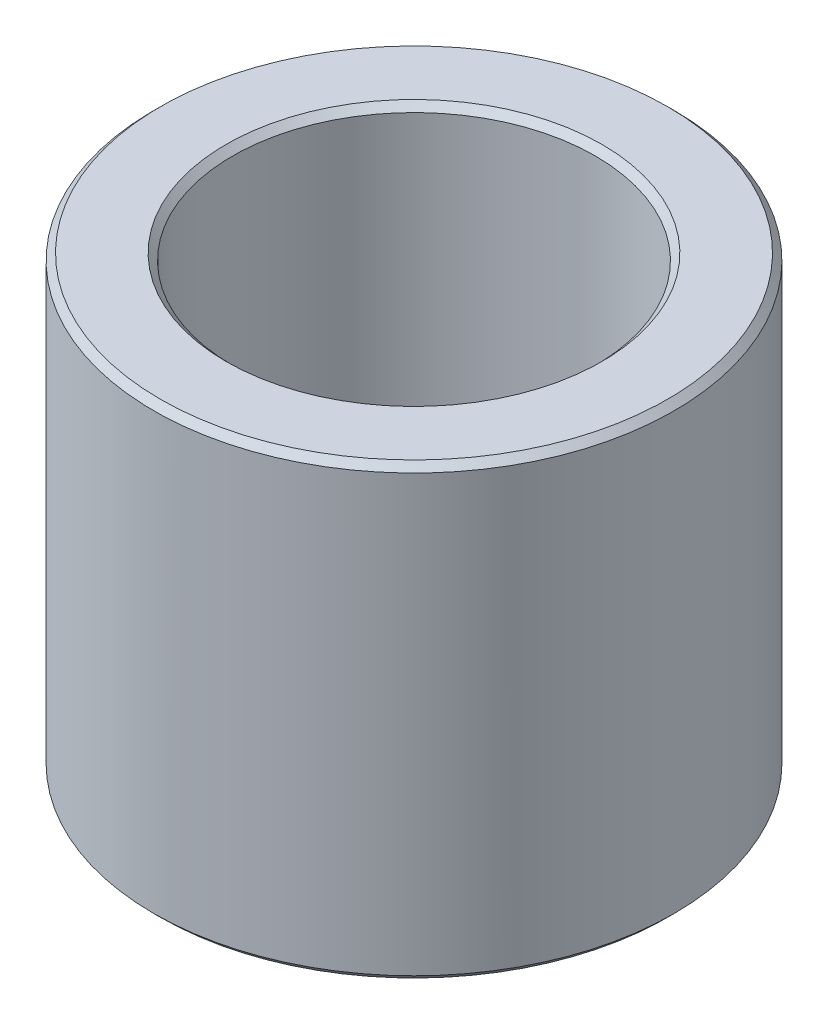
ISO-10303-21;
HEADER;
FILE_DESCRIPTION(('STEP AP214'),'2;1');
FILE_NAME('part.step','',(''),(''),'','','');
FILE_SCHEMA(('AUTOMOTIVE_DESIGN { 1 0 10303 214 1 1 1 1 }'));
ENDSEC;
DATA;
#1=APPLICATION_CONTEXT('core data for automotive mechanical design processes');
#2=APPLICATION_PROTOCOL_DEFINITION('international standard','automotive_design',2000,#1);
#3=PRODUCT_CONTEXT('',#1,'mechanical');
#4=PRODUCT('Part','Part','',(#3));
#5=PRODUCT_RELATED_PRODUCT_CATEGORY('part','',(#4));
#6=PRODUCT_DEFINITION_FORMATION('','',#4);
#7=PRODUCT_DEFINITION_CONTEXT('part definition',#1,'design');
#8=PRODUCT_DEFINITION('design','',#6,#7);
#9=PRODUCT_DEFINITION_SHAPE('','',#8);
#10=(LENGTH_UNIT() NAMED_UNIT(*) SI_UNIT(.MILLI.,.METRE.));
#11=(NAMED_UNIT(*) PLANE_ANGLE_UNIT() SI_UNIT($,.RADIAN.));
#12=(NAMED_UNIT(*) SI_UNIT($,.STERADIAN.) SOLID_ANGLE_UNIT());
#13=UNCERTAINTY_MEASURE_WITH_UNIT(LENGTH_MEASURE(1.E-05),#10,'distance_accuracy_value','');
#14=(GEOMETRIC_REPRESENTATION_CONTEXT(3) GLOBAL_UNCERTAINTY_ASSIGNED_CONTEXT((#13)) GLOBAL_UNIT_ASSIGNED_CONTEXT((#10,
#11,#12)) REPRESENTATION_CONTEXT('',''));
#15=CARTESIAN_POINT('',(0.,0.,0.));
#16=DIRECTION('',(0.,0.,1.));
#17=DIRECTION('',(1.,0.,0.));
#18=AXIS2_PLACEMENT_3D('',#15,#16,#17);
#19=CARTESIAN_POINT('',(0.,60.3581401144129,0.));
#20=DIRECTION('',(0.,-1.,0.));
#21=DIRECTION('',(0.,0.,-1.));
#22=AXIS2_PLACEMENT_3D('',#19,#20,#21);
#23=CYLINDRICAL_SURFACE('',#22,35.);
#24=CARTESIAN_POINT('',(0.,0.893999910343758,0.));
#25=DIRECTION('',(0.,1.,0.));
#26=DIRECTION('',(0.,0.,1.));
#27=AXIS2_PLACEMENT_3D('',#24,#25,#26);
#28=CIRCLE('',#27,35.);
#29=CARTESIAN_POINT('',(0.,0.893999910343751,-35.));
#30=VERTEX_POINT('',#29);
#31=EDGE_CURVE('E10',#30,#30,#28,.T.);
#32=CARTESIAN_POINT('',(0.,59.4641402040693,0.));
#33=DIRECTION('',(0.,1.,0.));
#34=DIRECTION('',(0.,0.,1.));
#35=AXIS2_PLACEMENT_3D('',#32,#33,#34);
#36=CIRCLE('',#35,35.);
#37=CARTESIAN_POINT('',(0.,59.4641402040693,-35.));
#38=VERTEX_POINT('',#37);
#39=EDGE_CURVE('E50',#38,#38,#36,.F.);
#40=CARTESIAN_POINT('',(0.,0.893999910343751,-35.));
#41=CARTESIAN_POINT('',(0.,1.50410553840339,-35.));
#42=CARTESIAN_POINT('',(0.,2.11421116646303,-35.));
#43=CARTESIAN_POINT('',(0.,3.33442242258232,-35.));
#44=CARTESIAN_POINT('',(0.,3.94452805064196,-35.));
#45=CARTESIAN_POINT('',(0.,5.16473930676124,-35.));
#46=CARTESIAN_POINT('',(0.,5.77484493482088,-35.));
#47=CARTESIAN_POINT('',(0.,6.99505619094016,-35.));
#48=CARTESIAN_POINT('',(0.,7.6051618189998,-35.));
#49=CARTESIAN_POINT('',(0.,8.82537307511908,-35.));
#50=CARTESIAN_POINT('',(0.,9.43547870317873,-35.));
#51=CARTESIAN_POINT('',(0.,10.655689959298,-35.));
#52=CARTESIAN_POINT('',(0.,11.2657955873576,-35.));
#53=CARTESIAN_POINT('',(0.,12.4860068434769,-35.));
#54=CARTESIAN_POINT('',(0.,13.0961124715366,-35.));
#55=CARTESIAN_POINT('',(0.,14.3163237276558,-35.));
#56=CARTESIAN_POINT('',(0.,14.9264293557155,-35.));
#57=CARTESIAN_POINT('',(0.,16.1466406118348,-35.));
#58=CARTESIAN_POINT('',(0.,16.7567462398944,-35.));
#59=CARTESIAN_POINT('',(0.,17.9769574960137,-35.));
#60=CARTESIAN_POINT('',(0.,18.5870631240733,-35.));
#61=CARTESIAN_POINT('',(0.,19.8072743801926,-35.));
#62=CARTESIAN_POINT('',(0.,20.4173800082523,-35.));
#63=CARTESIAN_POINT('',(0.,21.6375912643715,-35.));
#64=CARTESIAN_POINT('',(0.,22.2476968924312,-35.));
#65=CARTESIAN_POINT('',(0.,23.4679081485505,-35.));
#66=CARTESIAN_POINT('',(0.,24.0780137766101,-35.));
#67=CARTESIAN_POINT('',(0.,25.2982250327294,-35.));
#68=CARTESIAN_POINT('',(0.,25.908330660789,-35.));
#69=CARTESIAN_POINT('',(0.,27.1285419169083,-35.));
#70=CARTESIAN_POINT('',(0.,27.7386475449679,-35.));
#71=CARTESIAN_POINT('',(0.,28.9588588010872,-35.));
#72=CARTESIAN_POINT('',(0.,29.5689644291469,-35.));
#73=CARTESIAN_POINT('',(0.,30.7891756852661,-35.));
#74=CARTESIAN_POINT('',(0.,31.3992813133258,-35.));
#75=CARTESIAN_POINT('',(0.,32.6194925694451,-35.));
#76=CARTESIAN_POINT('',(0.,33.2295981975047,-35.));
#77=CARTESIAN_POINT('',(0.,34.449809453624,-35.));
#78=CARTESIAN_POINT('',(0.,35.0599150816836,-35.));
#79=CARTESIAN_POINT('',(0.,36.2801263378029,-35.));
#80=CARTESIAN_POINT('',(0.,36.8902319658626,-35.));
#81=CARTESIAN_POINT('',(0.,38.1104432219818,-35.));
#82=CARTESIAN_POINT('',(0.,38.7205488500415,-35.));
#83=CARTESIAN_POINT('',(0.,39.9407601061607,-35.));
#84=CARTESIAN_POINT('',(0.,40.5508657342204,-35.));
#85=CARTESIAN_POINT('',(0.,41.7710769903397,-35.));
#86=CARTESIAN_POINT('',(0.,42.3811826183993,-35.));
#87=CARTESIAN_POINT('',(0.,43.6013938745186,-35.));
#88=CARTESIAN_POINT('',(0.,44.2114995025782,-35.));
#89=CARTESIAN_POINT('',(0.,45.4317107586975,-35.));
#90=CARTESIAN_POINT('',(0.,46.0418163867572,-35.));
#91=CARTESIAN_POINT('',(0.,47.2620276428764,-35.));
#92=CARTESIAN_POINT('',(0.,47.8721332709361,-35.));
#93=CARTESIAN_POINT('',(0.,49.0923445270554,-35.));
#94=CARTESIAN_POINT('',(0.,49.702450155115,-35.));
#95=CARTESIAN_POINT('',(0.,50.9226614112343,-35.));
#96=CARTESIAN_POINT('',(0.,51.5327670392939,-35.));
#97=CARTESIAN_POINT('',(0.,52.7529782954132,-35.));
#98=CARTESIAN_POINT('',(0.,53.3630839234728,-35.));
#99=CARTESIAN_POINT('',(0.,54.5832951795921,-35.));
#100=CARTESIAN_POINT('',(0.,55.1934008076518,-35.));
#101=CARTESIAN_POINT('',(0.,56.413612063771,-35.));
#102=CARTESIAN_POINT('',(0.,57.0237176918307,-35.));
#103=CARTESIAN_POINT('',(0.,58.24392894795,-35.));
#104=CARTESIAN_POINT('',(0.,58.8540345760096,-35.));
#105=CARTESIAN_POINT('',(0.,59.4641402040693,-35.));
#106=B_SPLINE_CURVE_WITH_KNOTS('',3,(#40,#41,#42,#43,#44,#45,#46,#47,#48,#49,#50,#51,#52,#53,
#54,#55,#56,#57,#58,#59,#60,#61,#62,#63,#64,#65,#66,#67,#68,#69,#70,#71,#72,#73,#74,#75,#76,#77,
#78,#79,#80,#81,#82,#83,#84,#85,#86,#87,#88,#89,#90,#91,#92,#93,#94,#95,#96,#97,#98,#99,#100,
#101,#102,#103,#104,#105),.UNSPECIFIED.,.F.,.F.,(4,2,2,2,2,2,2,2,2,2,2,2,2,2,2,2,2,2,2,2,2,2,2,
2,2,2,2,2,2,2,2,2,4),(0.,1.83031688417892,3.66063376835785,5.49095065253677,7.32126753671569,
9.15158442089461,10.9819013050735,12.8122181892525,14.6425350734314,16.4728519576103,
18.3031688417892,20.1334857259681,21.9638026101471,23.794119494326,25.6244363785049,
27.4547532626838,29.2850701468628,31.1153870310417,32.9457039152206,34.7760207993995,
36.6063376835784,38.4366545677574,40.2669714519363,42.0972883361152,43.9276052202941,
45.757922104473,47.588238988652,49.4185558728309,51.2488727570098,53.0791896411887,
54.9095065253677,56.7398234095466,58.5701402937255),.UNSPECIFIED.);
#107=EDGE_CURVE('BSEAM39',#30,#38,#106,.T.);
#108=ORIENTED_EDGE('',*,*,#31,.T.);
#109=ORIENTED_EDGE('',*,*,#39,.T.);
#110=ORIENTED_EDGE('',*,*,#107,.T.);
#111=ORIENTED_EDGE('',*,*,#107,.F.);
#112=EDGE_LOOP('',(#108,#110,#109,#111));
#113=FACE_BOUND('',#112,.T.);
#114=ADVANCED_FACE('F39',(#113),#23,.T.);
#115=CARTESIAN_POINT('',(0.,60.3581401144129,0.));
#116=DIRECTION('',(0.,1.,0.));
#117=DIRECTION('',(0.,0.,1.));
#118=AXIS2_PLACEMENT_3D('',#115,#116,#117);
#119=PLANE('',#118);
#120=CARTESIAN_POINT('',(0.,60.3581401144129,0.));
#121=DIRECTION('',(0.,1.,0.));
#122=DIRECTION('',(0.,0.,1.));
#123=AXIS2_PLACEMENT_3D('',#120,#121,#122);
#124=CIRCLE('',#123,25.2929868113905);
#125=CARTESIAN_POINT('',(0.,60.3581401144129,25.2929868113905));
#126=VERTEX_POINT('',#125);
#127=EDGE_CURVE('E58',#126,#126,#124,.F.);
#128=ORIENTED_EDGE('',*,*,#127,.T.);
#129=EDGE_LOOP('',(#128));
#130=FACE_BOUND('',#129,.T.);
#131=CARTESIAN_POINT('',(0.,60.3581401144129,0.));
#132=DIRECTION('',(0.,1.,0.));
#133=DIRECTION('',(0.,0.,1.));
#134=AXIS2_PLACEMENT_3D('',#131,#132,#133);
#135=CIRCLE('',#134,34.1060000896564);
#136=CARTESIAN_POINT('',(0.,60.3581401144129,34.1060000896564));
#137=VERTEX_POINT('',#136);
#138=EDGE_CURVE('E61',#137,#137,#135,.T.);
#139=ORIENTED_EDGE('',*,*,#138,.T.);
#140=EDGE_LOOP('',(#139));
#141=FACE_BOUND('',#140,.T.);
#142=ADVANCED_FACE('F88',(#130,#141),#119,.T.);
#143=CARTESIAN_POINT('',(0.,0.,0.));
#144=DIRECTION('',(0.,1.,0.));
#145=DIRECTION('',(0.,0.,1.));
#146=AXIS2_PLACEMENT_3D('',#143,#144,#145);
#147=PLANE('',#146);
#148=CARTESIAN_POINT('',(0.,0.,0.));
#149=DIRECTION('',(0.,1.,0.));
#150=DIRECTION('',(0.,0.,1.));
#151=AXIS2_PLACEMENT_3D('',#148,#149,#150);
#152=CIRCLE('',#151,25.2929868113904);
#153=CARTESIAN_POINT('',(0.,0.,25.2929868113904));
#154=VERTEX_POINT('',#153);
#155=EDGE_CURVE('E51',#154,#154,#152,.T.);
#156=ORIENTED_EDGE('',*,*,#155,.T.);
#157=EDGE_LOOP('',(#156));
#158=FACE_BOUND('',#157,.T.);
#159=CARTESIAN_POINT('',(0.,0.,0.));
#160=DIRECTION('',(0.,1.,0.));
#161=DIRECTION('',(0.,0.,1.));
#162=AXIS2_PLACEMENT_3D('',#159,#160,#161);
#163=CIRCLE('',#162,34.1060000896562);
#164=CARTESIAN_POINT('',(0.,0.,34.1060000896562));
#165=VERTEX_POINT('',#164);
#166=EDGE_CURVE('E54',#165,#165,#163,.F.);
#167=ORIENTED_EDGE('',*,*,#166,.T.);
#168=EDGE_LOOP('',(#167));
#169=FACE_BOUND('',#168,.T.);
#170=ADVANCED_FACE('F83',(#158,#169),#147,.F.);
#171=CARTESIAN_POINT('',(0.,60.3581401144129,0.));
#172=DIRECTION('',(0.,-1.,0.));
#173=DIRECTION('',(0.,0.,-1.));
#174=AXIS2_PLACEMENT_3D('',#171,#172,#173);
#175=CYLINDRICAL_SURFACE('',#174,24.3989869010468);
#176=CARTESIAN_POINT('',(0.,59.4641402040691,0.));
#177=DIRECTION('',(0.,1.,0.));
#178=DIRECTION('',(0.,0.,1.));
#179=AXIS2_PLACEMENT_3D('',#176,#177,#178);
#180=CIRCLE('',#179,24.3989869010468);
#181=CARTESIAN_POINT('',(0.,59.4641402040691,-24.3989869010468));
#182=VERTEX_POINT('',#181);
#183=EDGE_CURVE('E67',#182,#182,#180,.T.);
#184=CARTESIAN_POINT('',(0.,0.893999910343647,0.));
#185=DIRECTION('',(0.,1.,0.));
#186=DIRECTION('',(0.,0.,1.));
#187=AXIS2_PLACEMENT_3D('',#184,#185,#186);
#188=CIRCLE('',#187,24.3989869010468);
#189=CARTESIAN_POINT('',(0.,0.89399991034364,-24.3989869010468));
#190=VERTEX_POINT('',#189);
#191=EDGE_CURVE('E69',#190,#190,#188,.F.);
#192=CARTESIAN_POINT('',(0.,59.4641402040691,-24.3989869010468));
#193=CARTESIAN_POINT('',(0.,58.8540345760095,-24.3989869010468));
#194=CARTESIAN_POINT('',(0.,58.2439289479498,-24.3989869010468));
#195=CARTESIAN_POINT('',(0.,57.0237176918306,-24.3989869010468));
#196=CARTESIAN_POINT('',(0.,56.4136120637709,-24.3989869010468));
#197=CARTESIAN_POINT('',(0.,55.1934008076516,-24.3989869010468));
#198=CARTESIAN_POINT('',(0.,54.583295179592,-24.3989869010468));
#199=CARTESIAN_POINT('',(0.,53.3630839234727,-24.3989869010468));
#200=CARTESIAN_POINT('',(0.,52.7529782954131,-24.3989869010468));
#201=CARTESIAN_POINT('',(0.,51.5327670392938,-24.3989869010468));
#202=CARTESIAN_POINT('',(0.,50.9226614112342,-24.3989869010468));
#203=CARTESIAN_POINT('',(0.,49.7024501551149,-24.3989869010468));
#204=CARTESIAN_POINT('',(0.,49.0923445270552,-24.3989869010468));
#205=CARTESIAN_POINT('',(0.,47.872133270936,-24.3989869010468));
#206=CARTESIAN_POINT('',(0.,47.2620276428763,-24.3989869010468));
#207=CARTESIAN_POINT('',(0.,46.041816386757,-24.3989869010468));
#208=CARTESIAN_POINT('',(0.,45.4317107586974,-24.3989869010468));
#209=CARTESIAN_POINT('',(0.,44.2114995025781,-24.3989869010468));
#210=CARTESIAN_POINT('',(0.,43.6013938745185,-24.3989869010468));
#211=CARTESIAN_POINT('',(0.,42.3811826183992,-24.3989869010468));
#212=CARTESIAN_POINT('',(0.,41.7710769903396,-24.3989869010468));
#213=CARTESIAN_POINT('',(0.,40.5508657342203,-24.3989869010468));
#214=CARTESIAN_POINT('',(0.,39.9407601061606,-24.3989869010468));
#215=CARTESIAN_POINT('',(0.,38.7205488500414,-24.3989869010468));
#216=CARTESIAN_POINT('',(0.,38.1104432219817,-24.3989869010468));
#217=CARTESIAN_POINT('',(0.,36.8902319658624,-24.3989869010468));
#218=CARTESIAN_POINT('',(0.,36.2801263378028,-24.3989869010468));
#219=CARTESIAN_POINT('',(0.,35.0599150816835,-24.3989869010468));
#220=CARTESIAN_POINT('',(0.,34.4498094536239,-24.3989869010468));
#221=CARTESIAN_POINT('',(0.,33.2295981975046,-24.3989869010468));
#222=CARTESIAN_POINT('',(0.,32.6194925694449,-24.3989869010468));
#223=CARTESIAN_POINT('',(0.,31.3992813133257,-24.3989869010468));
#224=CARTESIAN_POINT('',(0.,30.789175685266,-24.3989869010468));
#225=CARTESIAN_POINT('',(0.,29.5689644291467,-24.3989869010468));
#226=CARTESIAN_POINT('',(0.,28.9588588010871,-24.3989869010468));
#227=CARTESIAN_POINT('',(0.,27.7386475449678,-24.3989869010468));
#228=CARTESIAN_POINT('',(0.,27.1285419169082,-24.3989869010468));
#229=CARTESIAN_POINT('',(0.,25.9083306607889,-24.3989869010468));
#230=CARTESIAN_POINT('',(0.,25.2982250327293,-24.3989869010468));
#231=CARTESIAN_POINT('',(0.,24.07801377661,-24.3989869010468));
#232=CARTESIAN_POINT('',(0.,23.4679081485503,-24.3989869010468));
#233=CARTESIAN_POINT('',(0.,22.2476968924311,-24.3989869010468));
#234=CARTESIAN_POINT('',(0.,21.6375912643714,-24.3989869010468));
#235=CARTESIAN_POINT('',(0.,20.4173800082521,-24.3989869010468));
#236=CARTESIAN_POINT('',(0.,19.8072743801925,-24.3989869010468));
#237=CARTESIAN_POINT('',(0.,18.5870631240732,-24.3989869010468));
#238=CARTESIAN_POINT('',(0.,17.9769574960136,-24.3989869010468));
#239=CARTESIAN_POINT('',(0.,16.7567462398943,-24.3989869010468));
#240=CARTESIAN_POINT('',(0.,16.1466406118347,-24.3989869010468));
#241=CARTESIAN_POINT('',(0.,14.9264293557154,-24.3989869010468));
#242=CARTESIAN_POINT('',(0.,14.3163237276557,-24.3989869010468));
#243=CARTESIAN_POINT('',(0.,13.0961124715364,-24.3989869010468));
#244=CARTESIAN_POINT('',(0.,12.4860068434768,-24.3989869010468));
#245=CARTESIAN_POINT('',(0.,11.2657955873575,-24.3989869010468));
#246=CARTESIAN_POINT('',(0.,10.6556899592979,-24.3989869010468));
#247=CARTESIAN_POINT('',(0.,9.4354787031786,-24.3989869010468));
#248=CARTESIAN_POINT('',(0.,8.82537307511896,-24.3989869010468));
#249=CARTESIAN_POINT('',(0.,7.60516181899968,-24.3989869010468));
#250=CARTESIAN_POINT('',(0.,6.99505619094004,-24.3989869010468));
#251=CARTESIAN_POINT('',(0.,5.77484493482076,-24.3989869010468));
#252=CARTESIAN_POINT('',(0.,5.16473930676112,-24.3989869010468));
#253=CARTESIAN_POINT('',(0.,3.94452805064184,-24.3989869010468));
#254=CARTESIAN_POINT('',(0.,3.3344224225822,-24.3989869010468));
#255=CARTESIAN_POINT('',(0.,2.11421116646292,-24.3989869010468));
#256=CARTESIAN_POINT('',(0.,1.50410553840328,-24.3989869010468));
#257=CARTESIAN_POINT('',(0.,0.89399991034364,-24.3989869010468));
#258=B_SPLINE_CURVE_WITH_KNOTS('',3,(#192,#193,#194,#195,#196,#197,#198,#199,#200,#201,#202,
#203,#204,#205,#206,#207,#208,#209,#210,#211,#212,#213,#214,#215,#216,#217,#218,#219,#220,#221,
#222,#223,#224,#225,#226,#227,#228,#229,#230,#231,#232,#233,#234,#235,#236,#237,#238,#239,#240,
#241,#242,#243,#244,#245,#246,#247,#248,#249,#250,#251,#252,#253,#254,#255,#256,#257),
.UNSPECIFIED.,.F.,.F.,(4,2,2,2,2,2,2,2,2,2,2,2,2,2,2,2,2,2,2,2,2,2,2,2,2,2,2,2,2,2,2,2,4),(0.,
1.83031688417892,3.66063376835785,5.49095065253677,7.32126753671568,9.15158442089461,
10.9819013050735,12.8122181892525,14.6425350734314,16.4728519576103,18.3031688417892,
20.1334857259681,21.9638026101471,23.794119494326,25.6244363785049,27.4547532626838,
29.2850701468627,31.1153870310417,32.9457039152206,34.7760207993995,36.6063376835784,
38.4366545677574,40.2669714519363,42.0972883361152,43.9276052202941,45.757922104473,
47.588238988652,49.4185558728309,51.2488727570098,53.0791896411887,54.9095065253676,
56.7398234095466,58.5701402937255),.UNSPECIFIED.);
#259=EDGE_CURVE('BSEAM71',#182,#190,#258,.T.);
#260=ORIENTED_EDGE('',*,*,#183,.T.);
#261=ORIENTED_EDGE('',*,*,#191,.T.);
#262=ORIENTED_EDGE('',*,*,#259,.T.);
#263=ORIENTED_EDGE('',*,*,#259,.F.);
#264=EDGE_LOOP('',(#260,#262,#261,#263));
#265=FACE_BOUND('',#264,.T.);
#266=ADVANCED_FACE('F71',(#265),#175,.F.);
#267=CARTESIAN_POINT('',(0.,59.4641402040691,0.));
#268=DIRECTION('',(0.,1.,0.));
#269=DIRECTION('',(0.,0.,1.));
#270=AXIS2_PLACEMENT_3D('',#267,#268,#269);
#271=CONICAL_SURFACE('',#270,24.3989869010468,0.78539816339745);
#272=ORIENTED_EDGE('',*,*,#127,.F.);
#273=EDGE_LOOP('',(#272));
#274=FACE_BOUND('',#273,.T.);
#275=ORIENTED_EDGE('',*,*,#183,.F.);
#276=EDGE_LOOP('',(#275));
#277=FACE_BOUND('',#276,.T.);
#278=ADVANCED_FACE('F77',(#274,#277),#271,.F.);
#279=CARTESIAN_POINT('',(0.,0.,0.));
#280=DIRECTION('',(0.,-1.,0.));
#281=DIRECTION('',(0.,0.,-1.));
#282=AXIS2_PLACEMENT_3D('',#279,#280,#281);
#283=CONICAL_SURFACE('',#282,25.2929868113904,0.785398163397444);
#284=ORIENTED_EDGE('',*,*,#191,.F.);
#285=EDGE_LOOP('',(#284));
#286=FACE_BOUND('',#285,.T.);
#287=ORIENTED_EDGE('',*,*,#155,.F.);
#288=EDGE_LOOP('',(#287));
#289=FACE_BOUND('',#288,.T.);
#290=ADVANCED_FACE('F73',(#286,#289),#283,.F.);
#291=CARTESIAN_POINT('',(0.,0.893999910343758,0.));
#292=DIRECTION('',(0.,1.,0.));
#293=DIRECTION('',(0.,0.,1.));
#294=AXIS2_PLACEMENT_3D('',#291,#292,#293);
#295=CONICAL_SURFACE('',#294,35.,0.785398163397452);
#296=ORIENTED_EDGE('',*,*,#166,.F.);
#297=EDGE_LOOP('',(#296));
#298=FACE_BOUND('',#297,.T.);
#299=ORIENTED_EDGE('',*,*,#31,.F.);
#300=EDGE_LOOP('',(#299));
#301=FACE_BOUND('',#300,.T.);
#302=ADVANCED_FACE('F76',(#298,#301),#295,.T.);
#303=CARTESIAN_POINT('',(0.,60.3581401144129,0.));
#304=DIRECTION('',(0.,-1.,0.));
#305=DIRECTION('',(0.,0.,-1.));
#306=AXIS2_PLACEMENT_3D('',#303,#304,#305);
#307=CONICAL_SURFACE('',#306,34.1060000896564,0.785398163397448);
#308=ORIENTED_EDGE('',*,*,#39,.F.);
#309=EDGE_LOOP('',(#308));
#310=FACE_BOUND('',#309,.T.);
#311=ORIENTED_EDGE('',*,*,#138,.F.);
#312=EDGE_LOOP('',(#311));
#313=FACE_BOUND('',#312,.T.);
#314=ADVANCED_FACE('F45',(#310,#313),#307,.T.);
#315=CLOSED_SHELL('',(#114,#142,#170,#266,#278,#290,#302,#314));
#316=MANIFOLD_SOLID_BREP('B2',#315);
#317=ADVANCED_BREP_SHAPE_REPRESENTATION('',(#18,#316),#14);
#318=SHAPE_DEFINITION_REPRESENTATION(#9,#317);
ENDSEC;
END-ISO-10303-21;
